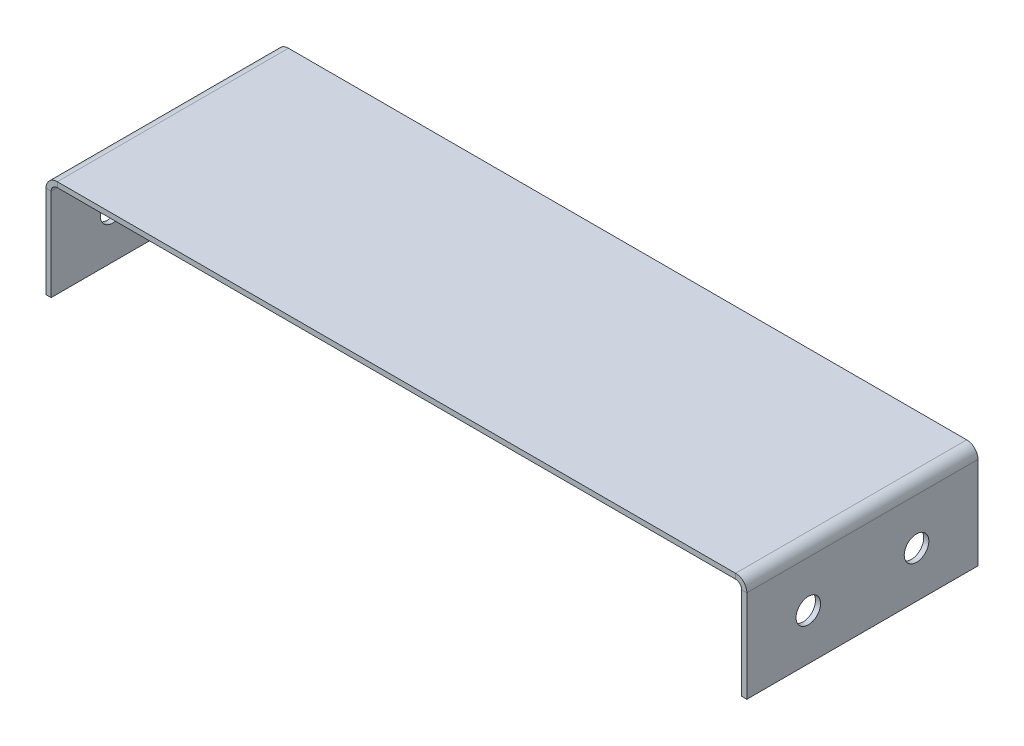
ISO-10303-21;
HEADER;
FILE_DESCRIPTION(('STEP AP214'),'2;1');
FILE_NAME('part.step','',(''),(''),'','','');
FILE_SCHEMA(('AUTOMOTIVE_DESIGN { 1 0 10303 214 1 1 1 1 }'));
ENDSEC;
DATA;
#1=APPLICATION_CONTEXT('core data for automotive mechanical design processes');
#2=APPLICATION_PROTOCOL_DEFINITION('international standard','automotive_design',2000,#1);
#3=PRODUCT_CONTEXT('',#1,'mechanical');
#4=PRODUCT('Part','Part','',(#3));
#5=PRODUCT_RELATED_PRODUCT_CATEGORY('part','',(#4));
#6=PRODUCT_DEFINITION_FORMATION('','',#4);
#7=PRODUCT_DEFINITION_CONTEXT('part definition',#1,'design');
#8=PRODUCT_DEFINITION('design','',#6,#7);
#9=PRODUCT_DEFINITION_SHAPE('','',#8);
#10=(LENGTH_UNIT() NAMED_UNIT(*) SI_UNIT(.MILLI.,.METRE.));
#11=(NAMED_UNIT(*) PLANE_ANGLE_UNIT() SI_UNIT($,.RADIAN.));
#12=(NAMED_UNIT(*) SI_UNIT($,.STERADIAN.) SOLID_ANGLE_UNIT());
#13=UNCERTAINTY_MEASURE_WITH_UNIT(LENGTH_MEASURE(1.E-05),#10,'distance_accuracy_value','');
#14=(GEOMETRIC_REPRESENTATION_CONTEXT(3) GLOBAL_UNCERTAINTY_ASSIGNED_CONTEXT((#13)) GLOBAL_UNIT_ASSIGNED_CONTEXT((#10,
#11,#12)) REPRESENTATION_CONTEXT('',''));
#15=CARTESIAN_POINT('',(0.,0.,0.));
#16=DIRECTION('',(0.,0.,1.));
#17=DIRECTION('',(1.,0.,0.));
#18=AXIS2_PLACEMENT_3D('',#15,#16,#17);
#19=CARTESIAN_POINT('',(0.,-2.65684,0.));
#20=DIRECTION('',(0.,-1.,0.));
#21=DIRECTION('',(0.,0.,-1.));
#22=AXIS2_PLACEMENT_3D('',#19,#20,#21);
#23=PLANE('',#22);
#24=DIRECTION('',(-1.,0.,0.));
#25=VECTOR('',#24,1.);
#26=CARTESIAN_POINT('',(0.,-2.65684,-119.38));
#27=LINE('',#26,#25);
#28=CARTESIAN_POINT('',(356.11816,-2.65684,-119.38));
#29=VERTEX_POINT('',#28);
#30=CARTESIAN_POINT('',(5.83184,-2.65684,-119.38));
#31=VERTEX_POINT('',#30);
#32=EDGE_CURVE('E13',#29,#31,#27,.T.);
#33=ORIENTED_EDGE('',*,*,#32,.F.);
#34=DIRECTION('',(0.,0.,1.));
#35=VECTOR('',#34,1.);
#36=CARTESIAN_POINT('',(356.11816,-2.65684,0.));
#37=LINE('',#36,#35);
#38=CARTESIAN_POINT('',(356.11816,-2.65684,0.));
#39=VERTEX_POINT('',#38);
#40=EDGE_CURVE('E225',#39,#29,#37,.F.);
#41=ORIENTED_EDGE('',*,*,#40,.F.);
#42=DIRECTION('',(1.,0.,0.));
#43=VECTOR('',#42,1.);
#44=CARTESIAN_POINT('',(0.,-2.65684,0.));
#45=LINE('',#44,#43);
#46=CARTESIAN_POINT('',(5.83184000000001,-2.65684,0.));
#47=VERTEX_POINT('',#46);
#48=EDGE_CURVE('E87',#47,#39,#45,.T.);
#49=ORIENTED_EDGE('',*,*,#48,.F.);
#50=DIRECTION('',(0.,0.,-1.));
#51=VECTOR('',#50,1.);
#52=CARTESIAN_POINT('',(5.83183999999999,-2.65683999999999,-119.38));
#53=LINE('',#52,#51);
#54=EDGE_CURVE('E279',#31,#47,#53,.F.);
#55=ORIENTED_EDGE('',*,*,#54,.F.);
#56=EDGE_LOOP('',(#33,#41,#49,#55));
#57=FACE_BOUND('',#56,.T.);
#58=ADVANCED_FACE('F78',(#57),#23,.T.);
#59=CARTESIAN_POINT('',(0.,0.,0.));
#60=DIRECTION('',(0.,-1.,0.));
#61=DIRECTION('',(0.,0.,-1.));
#62=AXIS2_PLACEMENT_3D('',#59,#60,#61);
#63=PLANE('',#62);
#64=DIRECTION('',(0.,0.,1.));
#65=VECTOR('',#64,1.);
#66=CARTESIAN_POINT('',(356.11816,0.,0.));
#67=LINE('',#66,#65);
#68=CARTESIAN_POINT('',(356.11816,0.,0.));
#69=VERTEX_POINT('',#68);
#70=CARTESIAN_POINT('',(356.11816,0.,-119.38));
#71=VERTEX_POINT('',#70);
#72=EDGE_CURVE('E213',#69,#71,#67,.F.);
#73=ORIENTED_EDGE('',*,*,#72,.T.);
#74=DIRECTION('',(-1.,0.,0.));
#75=VECTOR('',#74,1.);
#76=CARTESIAN_POINT('',(0.,0.,-119.38));
#77=LINE('',#76,#75);
#78=CARTESIAN_POINT('',(5.83184,0.,-119.38));
#79=VERTEX_POINT('',#78);
#80=EDGE_CURVE('E287',#71,#79,#77,.T.);
#81=ORIENTED_EDGE('',*,*,#80,.T.);
#82=DIRECTION('',(0.,0.,-1.));
#83=VECTOR('',#82,1.);
#84=CARTESIAN_POINT('',(5.83183999999999,0.,-119.38));
#85=LINE('',#84,#83);
#86=CARTESIAN_POINT('',(5.83184000000001,0.,0.));
#87=VERTEX_POINT('',#86);
#88=EDGE_CURVE('E267',#79,#87,#85,.F.);
#89=ORIENTED_EDGE('',*,*,#88,.T.);
#90=DIRECTION('',(1.,0.,0.));
#91=VECTOR('',#90,1.);
#92=CARTESIAN_POINT('',(0.,0.,0.));
#93=LINE('',#92,#91);
#94=EDGE_CURVE('E285',#87,#69,#93,.T.);
#95=ORIENTED_EDGE('',*,*,#94,.T.);
#96=EDGE_LOOP('',(#73,#81,#89,#95));
#97=FACE_BOUND('',#96,.T.);
#98=ADVANCED_FACE('F333',(#97),#63,.F.);
#99=CARTESIAN_POINT('',(0.,-2.65684,0.));
#100=DIRECTION('',(0.,0.,1.));
#101=DIRECTION('',(1.,0.,0.));
#102=AXIS2_PLACEMENT_3D('',#99,#100,#101);
#103=PLANE('',#102);
#104=ORIENTED_EDGE('',*,*,#48,.T.);
#105=DIRECTION('',(0.,1.,0.));
#106=VECTOR('',#105,1.);
#107=CARTESIAN_POINT('',(356.11816,-2.65684,0.));
#108=LINE('',#107,#106);
#109=EDGE_CURVE('E219',#39,#69,#108,.T.);
#110=ORIENTED_EDGE('',*,*,#109,.T.);
#111=ORIENTED_EDGE('',*,*,#94,.F.);
#112=DIRECTION('',(0.,1.,0.));
#113=VECTOR('',#112,1.);
#114=CARTESIAN_POINT('',(5.83184000000001,-2.65683999999999,0.));
#115=LINE('',#114,#113);
#116=EDGE_CURVE('E95',#47,#87,#115,.T.);
#117=ORIENTED_EDGE('',*,*,#116,.F.);
#118=EDGE_LOOP('',(#104,#110,#111,#117));
#119=FACE_BOUND('',#118,.T.);
#120=ADVANCED_FACE('F80',(#119),#103,.T.);
#121=CARTESIAN_POINT('',(0.,-2.65684,-119.38));
#122=DIRECTION('',(0.,0.,-1.));
#123=DIRECTION('',(-1.,0.,0.));
#124=AXIS2_PLACEMENT_3D('',#121,#122,#123);
#125=PLANE('',#124);
#126=DIRECTION('',(0.,1.,0.));
#127=VECTOR('',#126,1.);
#128=CARTESIAN_POINT('',(356.11816,-2.65684,-119.38));
#129=LINE('',#128,#127);
#130=EDGE_CURVE('E231',#29,#71,#129,.T.);
#131=ORIENTED_EDGE('',*,*,#130,.F.);
#132=ORIENTED_EDGE('',*,*,#32,.T.);
#133=DIRECTION('',(0.,1.,0.));
#134=VECTOR('',#133,1.);
#135=CARTESIAN_POINT('',(5.83183999999999,-2.65683999999999,-119.38));
#136=LINE('',#135,#134);
#137=EDGE_CURVE('E273',#31,#79,#136,.T.);
#138=ORIENTED_EDGE('',*,*,#137,.T.);
#139=ORIENTED_EDGE('',*,*,#80,.F.);
#140=EDGE_LOOP('',(#131,#132,#138,#139));
#141=FACE_BOUND('',#140,.T.);
#142=ADVANCED_FACE('F334',(#141),#125,.T.);
#143=CARTESIAN_POINT('',(5.83184,-5.83184,0.));
#144=DIRECTION('',(0.,0.,1.));
#145=DIRECTION('',(1.,0.,0.));
#146=AXIS2_PLACEMENT_3D('',#143,#144,#145);
#147=PLANE('',#146);
#148=DIRECTION('',(1.,0.,0.));
#149=VECTOR('',#148,1.);
#150=CARTESIAN_POINT('',(0.,-5.83183999999998,0.));
#151=LINE('',#150,#149);
#152=CARTESIAN_POINT('',(2.65683999999999,-5.83183999999999,0.));
#153=VERTEX_POINT('',#152);
#154=CARTESIAN_POINT('',(0.,-5.83183999999998,0.));
#155=VERTEX_POINT('',#154);
#156=EDGE_CURVE('E234',#153,#155,#151,.F.);
#157=ORIENTED_EDGE('',*,*,#156,.F.);
#158=CARTESIAN_POINT('',(5.83184,-5.83184,0.));
#159=DIRECTION('',(0.,0.,-1.));
#160=DIRECTION('',(-1.,0.,0.));
#161=AXIS2_PLACEMENT_3D('',#158,#159,#160);
#162=CIRCLE('',#161,3.17500000000001);
#163=EDGE_CURVE('E276',#47,#153,#162,.F.);
#164=ORIENTED_EDGE('',*,*,#163,.F.);
#165=ORIENTED_EDGE('',*,*,#116,.T.);
#166=CARTESIAN_POINT('',(5.83184,-5.83184,0.));
#167=DIRECTION('',(0.,0.,-1.));
#168=DIRECTION('',(-1.,0.,0.));
#169=AXIS2_PLACEMENT_3D('',#166,#167,#168);
#170=CIRCLE('',#169,5.83184000000001);
#171=EDGE_CURVE('E269',#87,#155,#170,.F.);
#172=ORIENTED_EDGE('',*,*,#171,.T.);
#173=EDGE_LOOP('',(#157,#164,#165,#172));
#174=FACE_BOUND('',#173,.T.);
#175=ADVANCED_FACE('F362',(#174),#147,.T.);
#176=CARTESIAN_POINT('',(5.83183999999998,-5.83184,-119.38));
#177=DIRECTION('',(0.,0.,1.));
#178=DIRECTION('',(1.,0.,0.));
#179=AXIS2_PLACEMENT_3D('',#176,#177,#178);
#180=PLANE('',#179);
#181=CARTESIAN_POINT('',(5.83183999999998,-5.83184,-119.38));
#182=DIRECTION('',(0.,0.,-1.));
#183=DIRECTION('',(-1.,0.,0.));
#184=AXIS2_PLACEMENT_3D('',#181,#182,#183);
#185=CIRCLE('',#184,3.17500000000001);
#186=CARTESIAN_POINT('',(2.65683999999997,-5.83183999999999,-119.38));
#187=VERTEX_POINT('',#186);
#188=EDGE_CURVE('E240',#187,#31,#185,.T.);
#189=ORIENTED_EDGE('',*,*,#188,.F.);
#190=DIRECTION('',(1.,0.,0.));
#191=VECTOR('',#190,1.);
#192=CARTESIAN_POINT('',(2.65683999999999,-5.83183999999999,-119.38));
#193=LINE('',#192,#191);
#194=CARTESIAN_POINT('',(0.,-5.83183999999998,-119.38));
#195=VERTEX_POINT('',#194);
#196=EDGE_CURVE('E260',#187,#195,#193,.F.);
#197=ORIENTED_EDGE('',*,*,#196,.T.);
#198=CARTESIAN_POINT('',(5.83183999999998,-5.83184,-119.38));
#199=DIRECTION('',(0.,0.,-1.));
#200=DIRECTION('',(-1.,0.,0.));
#201=AXIS2_PLACEMENT_3D('',#198,#199,#200);
#202=CIRCLE('',#201,5.83184000000001);
#203=EDGE_CURVE('E270',#195,#79,#202,.T.);
#204=ORIENTED_EDGE('',*,*,#203,.T.);
#205=ORIENTED_EDGE('',*,*,#137,.F.);
#206=EDGE_LOOP('',(#189,#197,#204,#205));
#207=FACE_BOUND('',#206,.T.);
#208=ADVANCED_FACE('F359',(#207),#180,.F.);
#209=CARTESIAN_POINT('',(5.83183999999998,-5.83184,-119.38));
#210=DIRECTION('',(0.,0.,-1.));
#211=DIRECTION('',(-1.,0.,0.));
#212=AXIS2_PLACEMENT_3D('',#209,#210,#211);
#213=CYLINDRICAL_SURFACE('',#212,5.83184000000001);
#214=ORIENTED_EDGE('',*,*,#88,.F.);
#215=ORIENTED_EDGE('',*,*,#203,.F.);
#216=DIRECTION('',(0.,0.,-1.));
#217=VECTOR('',#216,1.);
#218=CARTESIAN_POINT('',(0.,-5.83183999999998,0.));
#219=LINE('',#218,#217);
#220=EDGE_CURVE('E258',#195,#155,#219,.F.);
#221=ORIENTED_EDGE('',*,*,#220,.T.);
#222=ORIENTED_EDGE('',*,*,#171,.F.);
#223=EDGE_LOOP('',(#214,#215,#221,#222));
#224=FACE_BOUND('',#223,.T.);
#225=ADVANCED_FACE('F426',(#224),#213,.T.);
#226=CARTESIAN_POINT('',(5.83183999999998,-5.83184,-119.38));
#227=DIRECTION('',(0.,0.,-1.));
#228=DIRECTION('',(-1.,0.,0.));
#229=AXIS2_PLACEMENT_3D('',#226,#227,#228);
#230=CYLINDRICAL_SURFACE('',#229,3.17500000000001);
#231=ORIENTED_EDGE('',*,*,#54,.T.);
#232=ORIENTED_EDGE('',*,*,#163,.T.);
#233=DIRECTION('',(0.,0.,-1.));
#234=VECTOR('',#233,1.);
#235=CARTESIAN_POINT('',(2.65683999999999,-5.83183999999999,0.));
#236=LINE('',#235,#234);
#237=EDGE_CURVE('E263',#153,#187,#236,.T.);
#238=ORIENTED_EDGE('',*,*,#237,.T.);
#239=ORIENTED_EDGE('',*,*,#188,.T.);
#240=EDGE_LOOP('',(#231,#232,#238,#239));
#241=FACE_BOUND('',#240,.T.);
#242=ADVANCED_FACE('F415',(#241),#230,.F.);
#243=CARTESIAN_POINT('',(-1.77375475418629E-13,-53.45684,-119.38));
#244=DIRECTION('',(0.,0.,1.));
#245=DIRECTION('',(1.,0.,0.));
#246=AXIS2_PLACEMENT_3D('',#243,#244,#245);
#247=PLANE('',#246);
#248=ORIENTED_EDGE('',*,*,#196,.F.);
#249=DIRECTION('',(0.,1.,0.));
#250=VECTOR('',#249,1.);
#251=CARTESIAN_POINT('',(2.65683999999982,-53.45684,-119.38));
#252=LINE('',#251,#250);
#253=CARTESIAN_POINT('',(2.65683999999982,-53.45684,-119.38));
#254=VERTEX_POINT('',#253);
#255=EDGE_CURVE('E256',#187,#254,#252,.F.);
#256=ORIENTED_EDGE('',*,*,#255,.T.);
#257=DIRECTION('',(1.,0.,0.));
#258=VECTOR('',#257,1.);
#259=CARTESIAN_POINT('',(-1.77375475418629E-13,-53.45684,-119.38));
#260=LINE('',#259,#258);
#261=CARTESIAN_POINT('',(-1.77536261044645E-13,-53.45684,-119.38));
#262=VERTEX_POINT('',#261);
#263=EDGE_CURVE('E237',#262,#254,#260,.T.);
#264=ORIENTED_EDGE('',*,*,#263,.F.);
#265=DIRECTION('',(0.,-1.,0.));
#266=VECTOR('',#265,1.);
#267=CARTESIAN_POINT('',(0.,0.,-119.38));
#268=LINE('',#267,#266);
#269=EDGE_CURVE('E249',#195,#262,#268,.T.);
#270=ORIENTED_EDGE('',*,*,#269,.F.);
#271=EDGE_LOOP('',(#248,#256,#264,#270));
#272=FACE_BOUND('',#271,.T.);
#273=ADVANCED_FACE('F402',(#272),#247,.F.);
#274=CARTESIAN_POINT('',(0.,-2.65683999999999,0.));
#275=DIRECTION('',(0.,0.,-1.));
#276=DIRECTION('',(-1.,0.,0.));
#277=AXIS2_PLACEMENT_3D('',#274,#275,#276);
#278=PLANE('',#277);
#279=ORIENTED_EDGE('',*,*,#156,.T.);
#280=DIRECTION('',(0.,1.,0.));
#281=VECTOR('',#280,1.);
#282=CARTESIAN_POINT('',(0.,0.,0.));
#283=LINE('',#282,#281);
#284=CARTESIAN_POINT('',(-1.77536261044645E-13,-53.45684,0.));
#285=VERTEX_POINT('',#284);
#286=EDGE_CURVE('E244',#285,#155,#283,.T.);
#287=ORIENTED_EDGE('',*,*,#286,.F.);
#288=DIRECTION('',(1.,0.,0.));
#289=VECTOR('',#288,1.);
#290=CARTESIAN_POINT('',(-1.77367252013231E-13,-53.45684,0.));
#291=LINE('',#290,#289);
#292=CARTESIAN_POINT('',(2.65683999999982,-53.45684,0.));
#293=VERTEX_POINT('',#292);
#294=EDGE_CURVE('E241',#285,#293,#291,.T.);
#295=ORIENTED_EDGE('',*,*,#294,.T.);
#296=DIRECTION('',(0.,-1.,0.));
#297=VECTOR('',#296,1.);
#298=CARTESIAN_POINT('',(2.65684,-2.65684,0.));
#299=LINE('',#298,#297);
#300=EDGE_CURVE('E251',#293,#153,#299,.F.);
#301=ORIENTED_EDGE('',*,*,#300,.T.);
#302=EDGE_LOOP('',(#279,#287,#295,#301));
#303=FACE_BOUND('',#302,.T.);
#304=ADVANCED_FACE('F396',(#303),#278,.F.);
#305=CARTESIAN_POINT('',(0.,0.,0.));
#306=DIRECTION('',(1.,0.,0.));
#307=DIRECTION('',(0.,1.,0.));
#308=AXIS2_PLACEMENT_3D('',#305,#306,#307);
#309=PLANE('',#308);
#310=CARTESIAN_POINT('',(-1.03502659912321E-13,-29.64434,-87.63));
#311=DIRECTION('',(-1.,0.,0.));
#312=DIRECTION('',(0.,-1.,0.));
#313=AXIS2_PLACEMENT_3D('',#310,#311,#312);
#314=CIRCLE('',#313,6.35);
#315=CARTESIAN_POINT('',(-1.25673566413975E-13,-35.99434,-87.63));
#316=VERTEX_POINT('',#315);
#317=EDGE_CURVE('E299',#316,#316,#314,.T.);
#318=ORIENTED_EDGE('',*,*,#317,.F.);
#319=EDGE_LOOP('',(#318));
#320=FACE_BOUND('',#319,.T.);
#321=CARTESIAN_POINT('',(-1.03502659912321E-13,-29.64434,-31.75));
#322=DIRECTION('',(-1.,0.,0.));
#323=DIRECTION('',(0.,-1.,0.));
#324=AXIS2_PLACEMENT_3D('',#321,#322,#323);
#325=CIRCLE('',#324,6.35);
#326=CARTESIAN_POINT('',(-1.25673566413975E-13,-35.99434,-31.75));
#327=VERTEX_POINT('',#326);
#328=EDGE_CURVE('E309',#327,#327,#325,.T.);
#329=ORIENTED_EDGE('',*,*,#328,.F.);
#330=EDGE_LOOP('',(#329));
#331=FACE_BOUND('',#330,.T.);
#332=ORIENTED_EDGE('',*,*,#220,.F.);
#333=ORIENTED_EDGE('',*,*,#269,.T.);
#334=DIRECTION('',(0.,0.,1.));
#335=VECTOR('',#334,1.);
#336=CARTESIAN_POINT('',(-1.77536261044645E-13,-53.45684,0.));
#337=LINE('',#336,#335);
#338=EDGE_CURVE('E247',#262,#285,#337,.T.);
#339=ORIENTED_EDGE('',*,*,#338,.T.);
#340=ORIENTED_EDGE('',*,*,#286,.T.);
#341=EDGE_LOOP('',(#332,#333,#339,#340));
#342=FACE_BOUND('',#341,.T.);
#343=ADVANCED_FACE('F401',(#320,#331,#342),#309,.F.);
#344=CARTESIAN_POINT('',(2.65684000000001,0.,0.));
#345=DIRECTION('',(1.,0.,0.));
#346=DIRECTION('',(0.,1.,0.));
#347=AXIS2_PLACEMENT_3D('',#344,#345,#346);
#348=PLANE('',#347);
#349=CARTESIAN_POINT('',(2.65683999999988,-29.64434,-87.63));
#350=DIRECTION('',(1.,0.,0.));
#351=DIRECTION('',(0.,1.,0.));
#352=AXIS2_PLACEMENT_3D('',#349,#350,#351);
#353=CIRCLE('',#352,6.35);
#354=CARTESIAN_POINT('',(2.6568399999999,-23.29434,-87.63));
#355=VERTEX_POINT('',#354);
#356=EDGE_CURVE('E212',#355,#355,#353,.T.);
#357=ORIENTED_EDGE('',*,*,#356,.F.);
#358=EDGE_LOOP('',(#357));
#359=FACE_BOUND('',#358,.T.);
#360=CARTESIAN_POINT('',(2.65683999999988,-29.64434,-31.75));
#361=DIRECTION('',(1.,0.,0.));
#362=DIRECTION('',(0.,1.,0.));
#363=AXIS2_PLACEMENT_3D('',#360,#361,#362);
#364=CIRCLE('',#363,6.35);
#365=CARTESIAN_POINT('',(2.6568399999999,-23.29434,-31.75));
#366=VERTEX_POINT('',#365);
#367=EDGE_CURVE('E292',#366,#366,#364,.T.);
#368=ORIENTED_EDGE('',*,*,#367,.F.);
#369=EDGE_LOOP('',(#368));
#370=FACE_BOUND('',#369,.T.);
#371=ORIENTED_EDGE('',*,*,#255,.F.);
#372=ORIENTED_EDGE('',*,*,#237,.F.);
#373=ORIENTED_EDGE('',*,*,#300,.F.);
#374=DIRECTION('',(0.,0.,-1.));
#375=VECTOR('',#374,1.);
#376=CARTESIAN_POINT('',(2.65683999999982,-53.45684,0.));
#377=LINE('',#376,#375);
#378=EDGE_CURVE('E254',#254,#293,#377,.F.);
#379=ORIENTED_EDGE('',*,*,#378,.F.);
#380=EDGE_LOOP('',(#371,#372,#373,#379));
#381=FACE_BOUND('',#380,.T.);
#382=ADVANCED_FACE('F347',(#359,#370,#381),#348,.T.);
#383=CARTESIAN_POINT('',(-1.77375475418629E-13,-53.45684,0.));
#384=DIRECTION('',(0.,1.,0.));
#385=DIRECTION('',(-1.,0.,0.));
#386=AXIS2_PLACEMENT_3D('',#383,#384,#385);
#387=PLANE('',#386);
#388=ORIENTED_EDGE('',*,*,#378,.T.);
#389=ORIENTED_EDGE('',*,*,#294,.F.);
#390=ORIENTED_EDGE('',*,*,#338,.F.);
#391=ORIENTED_EDGE('',*,*,#263,.T.);
#392=EDGE_LOOP('',(#388,#389,#390,#391));
#393=FACE_BOUND('',#392,.T.);
#394=ADVANCED_FACE('F340',(#393),#387,.F.);
#395=CARTESIAN_POINT('',(356.11816,-5.83183999999999,-119.38));
#396=DIRECTION('',(0.,0.,-1.));
#397=DIRECTION('',(-1.,0.,0.));
#398=AXIS2_PLACEMENT_3D('',#395,#396,#397);
#399=PLANE('',#398);
#400=DIRECTION('',(-1.,0.,0.));
#401=VECTOR('',#400,1.);
#402=CARTESIAN_POINT('',(361.95,-5.83183999999997,-119.38));
#403=LINE('',#402,#401);
#404=CARTESIAN_POINT('',(359.29316,-5.83183999999998,-119.38));
#405=VERTEX_POINT('',#404);
#406=CARTESIAN_POINT('',(361.95,-5.83183999999997,-119.38));
#407=VERTEX_POINT('',#406);
#408=EDGE_CURVE('E194',#405,#407,#403,.F.);
#409=ORIENTED_EDGE('',*,*,#408,.F.);
#410=CARTESIAN_POINT('',(356.11816,-5.83183999999999,-119.38));
#411=DIRECTION('',(0.,0.,1.));
#412=DIRECTION('',(1.,0.,0.));
#413=AXIS2_PLACEMENT_3D('',#410,#411,#412);
#414=CIRCLE('',#413,3.17499999999998);
#415=EDGE_CURVE('E222',#29,#405,#414,.F.);
#416=ORIENTED_EDGE('',*,*,#415,.F.);
#417=ORIENTED_EDGE('',*,*,#130,.T.);
#418=CARTESIAN_POINT('',(356.11816,-5.83183999999999,-119.38));
#419=DIRECTION('',(0.,0.,1.));
#420=DIRECTION('',(1.,0.,0.));
#421=AXIS2_PLACEMENT_3D('',#418,#419,#420);
#422=CIRCLE('',#421,5.83183999999998);
#423=EDGE_CURVE('E215',#71,#407,#422,.F.);
#424=ORIENTED_EDGE('',*,*,#423,.T.);
#425=EDGE_LOOP('',(#409,#416,#417,#424));
#426=FACE_BOUND('',#425,.T.);
#427=ADVANCED_FACE('F338',(#426),#399,.T.);
#428=CARTESIAN_POINT('',(356.11816,-5.83183999999999,0.));
#429=DIRECTION('',(0.,0.,-1.));
#430=DIRECTION('',(-1.,0.,0.));
#431=AXIS2_PLACEMENT_3D('',#428,#429,#430);
#432=PLANE('',#431);
#433=CARTESIAN_POINT('',(356.11816,-5.83183999999999,0.));
#434=DIRECTION('',(0.,0.,1.));
#435=DIRECTION('',(1.,0.,0.));
#436=AXIS2_PLACEMENT_3D('',#433,#434,#435);
#437=CIRCLE('',#436,3.17499999999998);
#438=CARTESIAN_POINT('',(359.29316,-5.83183999999998,0.));
#439=VERTEX_POINT('',#438);
#440=EDGE_CURVE('E228',#439,#39,#437,.T.);
#441=ORIENTED_EDGE('',*,*,#440,.F.);
#442=DIRECTION('',(-1.,0.,0.));
#443=VECTOR('',#442,1.);
#444=CARTESIAN_POINT('',(359.29316,-5.83183999999998,0.));
#445=LINE('',#444,#443);
#446=CARTESIAN_POINT('',(361.95,-5.83183999999997,0.));
#447=VERTEX_POINT('',#446);
#448=EDGE_CURVE('E206',#439,#447,#445,.F.);
#449=ORIENTED_EDGE('',*,*,#448,.T.);
#450=CARTESIAN_POINT('',(356.11816,-5.83183999999999,0.));
#451=DIRECTION('',(0.,0.,1.));
#452=DIRECTION('',(1.,0.,0.));
#453=AXIS2_PLACEMENT_3D('',#450,#451,#452);
#454=CIRCLE('',#453,5.83183999999998);
#455=EDGE_CURVE('E216',#447,#69,#454,.T.);
#456=ORIENTED_EDGE('',*,*,#455,.T.);
#457=ORIENTED_EDGE('',*,*,#109,.F.);
#458=EDGE_LOOP('',(#441,#449,#456,#457));
#459=FACE_BOUND('',#458,.T.);
#460=ADVANCED_FACE('F326',(#459),#432,.F.);
#461=CARTESIAN_POINT('',(356.11816,-5.83183999999999,0.));
#462=DIRECTION('',(0.,0.,1.));
#463=DIRECTION('',(1.,0.,0.));
#464=AXIS2_PLACEMENT_3D('',#461,#462,#463);
#465=CYLINDRICAL_SURFACE('',#464,5.83183999999998);
#466=ORIENTED_EDGE('',*,*,#72,.F.);
#467=ORIENTED_EDGE('',*,*,#455,.F.);
#468=DIRECTION('',(0.,0.,1.));
#469=VECTOR('',#468,1.);
#470=CARTESIAN_POINT('',(361.95,-5.83183999999997,-119.38));
#471=LINE('',#470,#469);
#472=EDGE_CURVE('E204',#447,#407,#471,.F.);
#473=ORIENTED_EDGE('',*,*,#472,.T.);
#474=ORIENTED_EDGE('',*,*,#423,.F.);
#475=EDGE_LOOP('',(#466,#467,#473,#474));
#476=FACE_BOUND('',#475,.T.);
#477=ADVANCED_FACE('F330',(#476),#465,.T.);
#478=CARTESIAN_POINT('',(356.11816,-5.83183999999999,0.));
#479=DIRECTION('',(0.,0.,1.));
#480=DIRECTION('',(1.,0.,0.));
#481=AXIS2_PLACEMENT_3D('',#478,#479,#480);
#482=CYLINDRICAL_SURFACE('',#481,3.17499999999998);
#483=ORIENTED_EDGE('',*,*,#40,.T.);
#484=ORIENTED_EDGE('',*,*,#415,.T.);
#485=DIRECTION('',(0.,0.,1.));
#486=VECTOR('',#485,1.);
#487=CARTESIAN_POINT('',(359.29316,-5.83183999999998,-119.38));
#488=LINE('',#487,#486);
#489=EDGE_CURVE('E209',#405,#439,#488,.T.);
#490=ORIENTED_EDGE('',*,*,#489,.T.);
#491=ORIENTED_EDGE('',*,*,#440,.T.);
#492=EDGE_LOOP('',(#483,#484,#490,#491));
#493=FACE_BOUND('',#492,.T.);
#494=ADVANCED_FACE('F322',(#493),#482,.F.);
#495=CARTESIAN_POINT('',(361.95,-53.45684,0.));
#496=DIRECTION('',(0.,0.,-1.));
#497=DIRECTION('',(-1.,0.,0.));
#498=AXIS2_PLACEMENT_3D('',#495,#496,#497);
#499=PLANE('',#498);
#500=ORIENTED_EDGE('',*,*,#448,.F.);
#501=DIRECTION('',(0.,1.,0.));
#502=VECTOR('',#501,1.);
#503=CARTESIAN_POINT('',(359.29316,-53.45684,0.));
#504=LINE('',#503,#502);
#505=CARTESIAN_POINT('',(359.29316,-53.45684,0.));
#506=VERTEX_POINT('',#505);
#507=EDGE_CURVE('E202',#439,#506,#504,.F.);
#508=ORIENTED_EDGE('',*,*,#507,.T.);
#509=DIRECTION('',(-1.,0.,0.));
#510=VECTOR('',#509,1.);
#511=CARTESIAN_POINT('',(361.95,-53.45684,0.));
#512=LINE('',#511,#510);
#513=CARTESIAN_POINT('',(361.95,-53.45684,0.));
#514=VERTEX_POINT('',#513);
#515=EDGE_CURVE('E190',#514,#506,#512,.T.);
#516=ORIENTED_EDGE('',*,*,#515,.F.);
#517=DIRECTION('',(0.,-1.,0.));
#518=VECTOR('',#517,1.);
#519=CARTESIAN_POINT('',(361.95,1.19582716484843E-12,0.));
#520=LINE('',#519,#518);
#521=EDGE_CURVE('E177',#447,#514,#520,.T.);
#522=ORIENTED_EDGE('',*,*,#521,.F.);
#523=EDGE_LOOP('',(#500,#508,#516,#522));
#524=FACE_BOUND('',#523,.T.);
#525=ADVANCED_FACE('F315',(#524),#499,.F.);
#526=CARTESIAN_POINT('',(361.95,-2.65683999999999,-119.38));
#527=DIRECTION('',(0.,0.,1.));
#528=DIRECTION('',(1.,0.,0.));
#529=AXIS2_PLACEMENT_3D('',#526,#527,#528);
#530=PLANE('',#529);
#531=ORIENTED_EDGE('',*,*,#408,.T.);
#532=DIRECTION('',(0.,1.,0.));
#533=VECTOR('',#532,1.);
#534=CARTESIAN_POINT('',(361.95,1.19582716484843E-12,-119.38));
#535=LINE('',#534,#533);
#536=CARTESIAN_POINT('',(361.95,-53.45684,-119.38));
#537=VERTEX_POINT('',#536);
#538=EDGE_CURVE('E175',#537,#407,#535,.T.);
#539=ORIENTED_EDGE('',*,*,#538,.F.);
#540=DIRECTION('',(-1.,0.,0.));
#541=VECTOR('',#540,1.);
#542=CARTESIAN_POINT('',(361.95,-53.45684,-119.38));
#543=LINE('',#542,#541);
#544=CARTESIAN_POINT('',(359.29316,-53.45684,-119.38));
#545=VERTEX_POINT('',#544);
#546=EDGE_CURVE('E183',#537,#545,#543,.T.);
#547=ORIENTED_EDGE('',*,*,#546,.T.);
#548=DIRECTION('',(0.,-1.,0.));
#549=VECTOR('',#548,1.);
#550=CARTESIAN_POINT('',(359.29316,-2.65684,-119.38));
#551=LINE('',#550,#549);
#552=EDGE_CURVE('E199',#545,#405,#551,.F.);
#553=ORIENTED_EDGE('',*,*,#552,.T.);
#554=EDGE_LOOP('',(#531,#539,#547,#553));
#555=FACE_BOUND('',#554,.T.);
#556=ADVANCED_FACE('F193',(#555),#530,.F.);
#557=CARTESIAN_POINT('',(361.95,1.19582716484843E-12,0.));
#558=DIRECTION('',(-1.,0.,0.));
#559=DIRECTION('',(0.,-1.,0.));
#560=AXIS2_PLACEMENT_3D('',#557,#558,#559);
#561=PLANE('',#560);
#562=CARTESIAN_POINT('',(361.95,-29.6443400000012,-87.63));
#563=DIRECTION('',(-1.,0.,0.));
#564=DIRECTION('',(0.,-1.,0.));
#565=AXIS2_PLACEMENT_3D('',#562,#563,#564);
#566=CIRCLE('',#565,6.35);
#567=CARTESIAN_POINT('',(361.95,-35.9943400000012,-87.63));
#568=VERTEX_POINT('',#567);
#569=EDGE_CURVE('E293',#568,#568,#566,.T.);
#570=ORIENTED_EDGE('',*,*,#569,.T.);
#571=EDGE_LOOP('',(#570));
#572=FACE_BOUND('',#571,.T.);
#573=CARTESIAN_POINT('',(361.95,-29.6443400000012,-31.75));
#574=DIRECTION('',(-1.,0.,0.));
#575=DIRECTION('',(0.,-1.,0.));
#576=AXIS2_PLACEMENT_3D('',#573,#574,#575);
#577=CIRCLE('',#576,6.35);
#578=CARTESIAN_POINT('',(361.95,-35.9943400000013,-31.75));
#579=VERTEX_POINT('',#578);
#580=EDGE_CURVE('E304',#579,#579,#577,.T.);
#581=ORIENTED_EDGE('',*,*,#580,.T.);
#582=EDGE_LOOP('',(#581));
#583=FACE_BOUND('',#582,.T.);
#584=ORIENTED_EDGE('',*,*,#472,.F.);
#585=ORIENTED_EDGE('',*,*,#521,.T.);
#586=DIRECTION('',(0.,0.,-1.));
#587=VECTOR('',#586,1.);
#588=CARTESIAN_POINT('',(361.95,-53.45684,0.));
#589=LINE('',#588,#587);
#590=EDGE_CURVE('E170',#514,#537,#589,.T.);
#591=ORIENTED_EDGE('',*,*,#590,.T.);
#592=ORIENTED_EDGE('',*,*,#538,.T.);
#593=EDGE_LOOP('',(#584,#585,#591,#592));
#594=FACE_BOUND('',#593,.T.);
#595=ADVANCED_FACE('F173',(#572,#583,#594),#561,.F.);
#596=CARTESIAN_POINT('',(359.29316,1.18655085756814E-12,0.));
#597=DIRECTION('',(-1.,0.,0.));
#598=DIRECTION('',(0.,-1.,0.));
#599=AXIS2_PLACEMENT_3D('',#596,#597,#598);
#600=PLANE('',#599);
#601=CARTESIAN_POINT('',(359.29316,-29.6443400000012,-87.63));
#602=DIRECTION('',(-1.,0.,0.));
#603=DIRECTION('',(0.,-1.,0.));
#604=AXIS2_PLACEMENT_3D('',#601,#602,#603);
#605=CIRCLE('',#604,6.35);
#606=CARTESIAN_POINT('',(359.29316,-35.9943400000012,-87.63));
#607=VERTEX_POINT('',#606);
#608=EDGE_CURVE('E82',#607,#607,#605,.T.);
#609=ORIENTED_EDGE('',*,*,#608,.F.);
#610=EDGE_LOOP('',(#609));
#611=FACE_BOUND('',#610,.T.);
#612=CARTESIAN_POINT('',(359.29316,-29.6443400000012,-31.75));
#613=DIRECTION('',(-1.,0.,0.));
#614=DIRECTION('',(0.,-1.,0.));
#615=AXIS2_PLACEMENT_3D('',#612,#613,#614);
#616=CIRCLE('',#615,6.35);
#617=CARTESIAN_POINT('',(359.29316,-35.9943400000012,-31.75));
#618=VERTEX_POINT('',#617);
#619=EDGE_CURVE('E290',#618,#618,#616,.T.);
#620=ORIENTED_EDGE('',*,*,#619,.F.);
#621=EDGE_LOOP('',(#620));
#622=FACE_BOUND('',#621,.T.);
#623=ORIENTED_EDGE('',*,*,#507,.F.);
#624=ORIENTED_EDGE('',*,*,#489,.F.);
#625=ORIENTED_EDGE('',*,*,#552,.F.);
#626=DIRECTION('',(0.,0.,1.));
#627=VECTOR('',#626,1.);
#628=CARTESIAN_POINT('',(359.29316,-53.45684,-119.38));
#629=LINE('',#628,#627);
#630=EDGE_CURVE('E186',#506,#545,#629,.F.);
#631=ORIENTED_EDGE('',*,*,#630,.F.);
#632=EDGE_LOOP('',(#623,#624,#625,#631));
#633=FACE_BOUND('',#632,.T.);
#634=ADVANCED_FACE('F319',(#611,#622,#633),#600,.T.);
#635=CARTESIAN_POINT('',(361.95,-53.45684,-119.38));
#636=DIRECTION('',(0.,1.,0.));
#637=DIRECTION('',(-1.,0.,0.));
#638=AXIS2_PLACEMENT_3D('',#635,#636,#637);
#639=PLANE('',#638);
#640=ORIENTED_EDGE('',*,*,#630,.T.);
#641=ORIENTED_EDGE('',*,*,#546,.F.);
#642=ORIENTED_EDGE('',*,*,#590,.F.);
#643=ORIENTED_EDGE('',*,*,#515,.T.);
#644=EDGE_LOOP('',(#640,#641,#642,#643));
#645=FACE_BOUND('',#644,.T.);
#646=ADVANCED_FACE('F184',(#645),#639,.F.);
#647=CARTESIAN_POINT('',(361.95,-29.6443400000012,-31.75));
#648=DIRECTION('',(-1.,0.,0.));
#649=DIRECTION('',(0.,-1.,0.));
#650=AXIS2_PLACEMENT_3D('',#647,#648,#649);
#651=CYLINDRICAL_SURFACE('',#650,6.35);
#652=ORIENTED_EDGE('',*,*,#619,.T.);
#653=EDGE_LOOP('',(#652));
#654=FACE_BOUND('',#653,.T.);
#655=ORIENTED_EDGE('',*,*,#580,.F.);
#656=EDGE_LOOP('',(#655));
#657=FACE_BOUND('',#656,.T.);
#658=ADVANCED_FACE('F518',(#654,#657),#651,.F.);
#659=CARTESIAN_POINT('',(361.95,-29.6443400000012,-87.63));
#660=DIRECTION('',(-1.,0.,0.));
#661=DIRECTION('',(0.,-1.,0.));
#662=AXIS2_PLACEMENT_3D('',#659,#660,#661);
#663=CYLINDRICAL_SURFACE('',#662,6.35);
#664=ORIENTED_EDGE('',*,*,#608,.T.);
#665=EDGE_LOOP('',(#664));
#666=FACE_BOUND('',#665,.T.);
#667=ORIENTED_EDGE('',*,*,#569,.F.);
#668=EDGE_LOOP('',(#667));
#669=FACE_BOUND('',#668,.T.);
#670=ADVANCED_FACE('F549',(#666,#669),#663,.F.);
#671=ORIENTED_EDGE('',*,*,#367,.T.);
#672=EDGE_LOOP('',(#671));
#673=FACE_BOUND('',#672,.T.);
#674=ORIENTED_EDGE('',*,*,#328,.T.);
#675=EDGE_LOOP('',(#674));
#676=FACE_BOUND('',#675,.T.);
#677=ADVANCED_FACE('F551',(#673,#676),#651,.F.);
#678=ORIENTED_EDGE('',*,*,#356,.T.);
#679=EDGE_LOOP('',(#678));
#680=FACE_BOUND('',#679,.T.);
#681=ORIENTED_EDGE('',*,*,#317,.T.);
#682=EDGE_LOOP('',(#681));
#683=FACE_BOUND('',#682,.T.);
#684=ADVANCED_FACE('F562',(#680,#683),#663,.F.);
#685=CLOSED_SHELL('',(#58,#98,#120,#142,#175,#208,#225,#242,#273,#304,#343,#382,#394,#427,#460,
#477,#494,#525,#556,#595,#634,#646,#658,#670,#677,#684));
#686=MANIFOLD_SOLID_BREP('B2',#685);
#687=ADVANCED_BREP_SHAPE_REPRESENTATION('',(#18,#686),#14);
#688=SHAPE_DEFINITION_REPRESENTATION(#9,#687);
ENDSEC;
END-ISO-10303-21;
